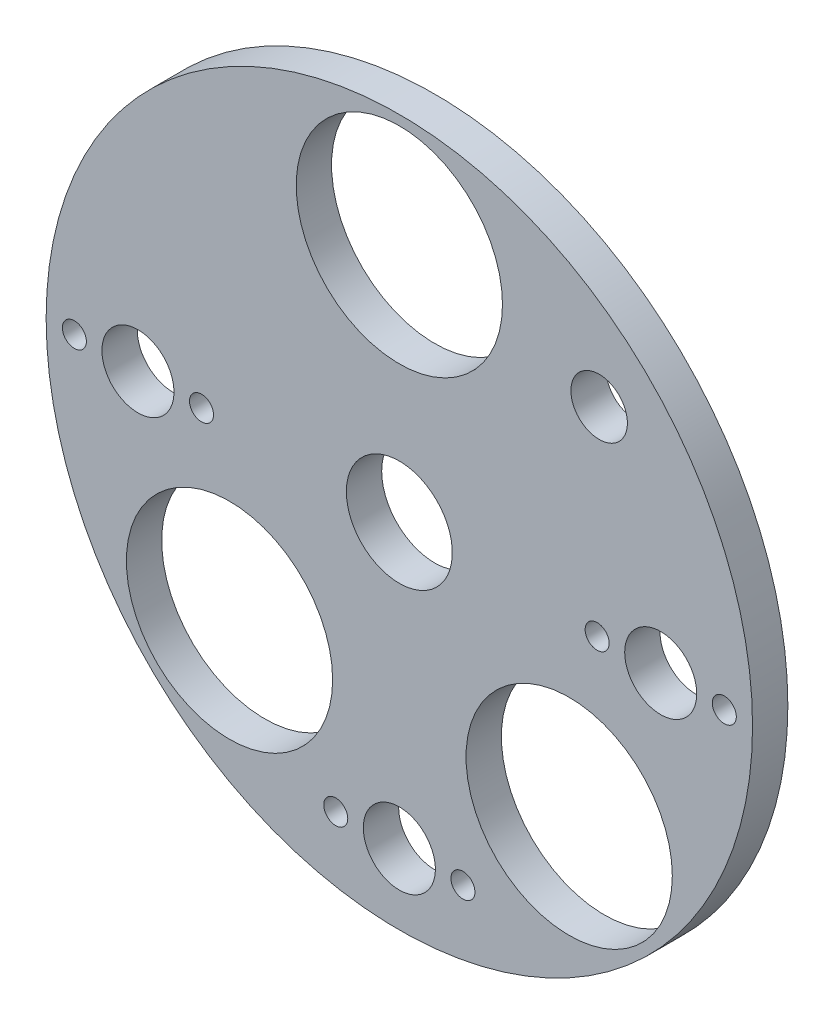
ISO-10303-21;
HEADER;
FILE_DESCRIPTION(('STEP AP214'),'2;1');
FILE_NAME('part.step','',(''),(''),'','','');
FILE_SCHEMA(('AUTOMOTIVE_DESIGN { 1 0 10303 214 1 1 1 1 }'));
ENDSEC;
DATA;
#1=APPLICATION_CONTEXT('core data for automotive mechanical design processes');
#2=APPLICATION_PROTOCOL_DEFINITION('international standard','automotive_design',2000,#1);
#3=PRODUCT_CONTEXT('',#1,'mechanical');
#4=PRODUCT('Part','Part','',(#3));
#5=PRODUCT_RELATED_PRODUCT_CATEGORY('part','',(#4));
#6=PRODUCT_DEFINITION_FORMATION('','',#4);
#7=PRODUCT_DEFINITION_CONTEXT('part definition',#1,'design');
#8=PRODUCT_DEFINITION('design','',#6,#7);
#9=PRODUCT_DEFINITION_SHAPE('','',#8);
#10=(LENGTH_UNIT() NAMED_UNIT(*) SI_UNIT(.MILLI.,.METRE.));
#11=(NAMED_UNIT(*) PLANE_ANGLE_UNIT() SI_UNIT($,.RADIAN.));
#12=(NAMED_UNIT(*) SI_UNIT($,.STERADIAN.) SOLID_ANGLE_UNIT());
#13=UNCERTAINTY_MEASURE_WITH_UNIT(LENGTH_MEASURE(1.E-05),#10,'distance_accuracy_value','');
#14=(GEOMETRIC_REPRESENTATION_CONTEXT(3) GLOBAL_UNCERTAINTY_ASSIGNED_CONTEXT((#13)) GLOBAL_UNIT_ASSIGNED_CONTEXT((#10,
#11,#12)) REPRESENTATION_CONTEXT('',''));
#15=CARTESIAN_POINT('',(0.,0.,0.));
#16=DIRECTION('',(0.,0.,1.));
#17=DIRECTION('',(1.,0.,0.));
#18=AXIS2_PLACEMENT_3D('',#15,#16,#17);
#19=CARTESIAN_POINT('',(0.,0.,5.));
#20=DIRECTION('',(0.,0.,-1.));
#21=DIRECTION('',(-1.,0.,0.));
#22=AXIS2_PLACEMENT_3D('',#19,#20,#21);
#23=CYLINDRICAL_SURFACE('',#22,50.);
#24=CARTESIAN_POINT('',(0.,0.,5.));
#25=DIRECTION('',(0.,0.,1.));
#26=DIRECTION('',(1.,0.,0.));
#27=AXIS2_PLACEMENT_3D('',#24,#25,#26);
#28=CIRCLE('',#27,50.);
#29=CARTESIAN_POINT('',(50.,0.,5.));
#30=VERTEX_POINT('',#29);
#31=EDGE_CURVE('E10',#30,#30,#28,.T.);
#32=ORIENTED_EDGE('',*,*,#31,.F.);
#33=EDGE_LOOP('',(#32));
#34=FACE_BOUND('',#33,.T.);
#35=CARTESIAN_POINT('',(0.,0.,0.));
#36=DIRECTION('',(0.,0.,1.));
#37=DIRECTION('',(1.,0.,0.));
#38=AXIS2_PLACEMENT_3D('',#35,#36,#37);
#39=CIRCLE('',#38,50.);
#40=CARTESIAN_POINT('',(50.,0.,0.));
#41=VERTEX_POINT('',#40);
#42=EDGE_CURVE('E39',#41,#41,#39,.T.);
#43=ORIENTED_EDGE('',*,*,#42,.T.);
#44=EDGE_LOOP('',(#43));
#45=FACE_BOUND('',#44,.T.);
#46=ADVANCED_FACE('F32',(#34,#45),#23,.T.);
#47=CARTESIAN_POINT('',(0.,0.,5.));
#48=DIRECTION('',(0.,0.,1.));
#49=DIRECTION('',(1.,0.,0.));
#50=AXIS2_PLACEMENT_3D('',#47,#48,#49);
#51=PLANE('',#50);
#52=CARTESIAN_POINT('',(28.284271247462,28.2842712474618,5.));
#53=DIRECTION('',(0.,0.,1.));
#54=DIRECTION('',(1.,0.,0.));
#55=AXIS2_PLACEMENT_3D('',#52,#53,#54);
#56=CIRCLE('',#55,4.);
#57=CARTESIAN_POINT('',(32.284271247462,28.2842712474618,5.));
#58=VERTEX_POINT('',#57);
#59=EDGE_CURVE('E154',#58,#58,#56,.T.);
#60=ORIENTED_EDGE('',*,*,#59,.F.);
#61=EDGE_LOOP('',(#60));
#62=FACE_BOUND('',#61,.T.);
#63=CARTESIAN_POINT('',(0.,34.,5.));
#64=DIRECTION('',(0.,0.,1.));
#65=DIRECTION('',(1.,0.,0.));
#66=AXIS2_PLACEMENT_3D('',#63,#64,#65);
#67=CIRCLE('',#66,14.6);
#68=CARTESIAN_POINT('',(14.6,34.,5.));
#69=VERTEX_POINT('',#68);
#70=EDGE_CURVE('E158',#69,#69,#67,.T.);
#71=ORIENTED_EDGE('',*,*,#70,.F.);
#72=EDGE_LOOP('',(#71));
#73=FACE_BOUND('',#72,.T.);
#74=CARTESIAN_POINT('',(-24.0416305603427,-24.0416305603425,5.));
#75=DIRECTION('',(0.,0.,1.));
#76=DIRECTION('',(1.,0.,0.));
#77=AXIS2_PLACEMENT_3D('',#74,#75,#76);
#78=CIRCLE('',#77,14.6);
#79=CARTESIAN_POINT('',(-9.44163056034274,-24.0416305603425,5.));
#80=VERTEX_POINT('',#79);
#81=EDGE_CURVE('E162',#80,#80,#78,.T.);
#82=ORIENTED_EDGE('',*,*,#81,.F.);
#83=EDGE_LOOP('',(#82));
#84=FACE_BOUND('',#83,.T.);
#85=CARTESIAN_POINT('',(24.0416305603426,-24.0416305603427,5.));
#86=DIRECTION('',(0.,0.,1.));
#87=DIRECTION('',(1.,0.,0.));
#88=AXIS2_PLACEMENT_3D('',#85,#86,#87);
#89=CIRCLE('',#88,14.6);
#90=CARTESIAN_POINT('',(38.6416305603426,-24.0416305603427,5.));
#91=VERTEX_POINT('',#90);
#92=EDGE_CURVE('E53',#91,#91,#89,.T.);
#93=ORIENTED_EDGE('',*,*,#92,.F.);
#94=EDGE_LOOP('',(#93));
#95=FACE_BOUND('',#94,.T.);
#96=CARTESIAN_POINT('',(46.,0.,5.));
#97=DIRECTION('',(0.,0.,1.));
#98=DIRECTION('',(1.,0.,0.));
#99=AXIS2_PLACEMENT_3D('',#96,#97,#98);
#100=CIRCLE('',#99,1.7);
#101=CARTESIAN_POINT('',(47.7,0.,5.));
#102=VERTEX_POINT('',#101);
#103=EDGE_CURVE('E57',#102,#102,#100,.T.);
#104=ORIENTED_EDGE('',*,*,#103,.F.);
#105=EDGE_LOOP('',(#104));
#106=FACE_BOUND('',#105,.T.);
#107=CARTESIAN_POINT('',(28.,0.,5.));
#108=DIRECTION('',(0.,0.,1.));
#109=DIRECTION('',(1.,0.,0.));
#110=AXIS2_PLACEMENT_3D('',#107,#108,#109);
#111=CIRCLE('',#110,1.7);
#112=CARTESIAN_POINT('',(29.7,0.,5.));
#113=VERTEX_POINT('',#112);
#114=EDGE_CURVE('E66',#113,#113,#111,.T.);
#115=ORIENTED_EDGE('',*,*,#114,.F.);
#116=EDGE_LOOP('',(#115));
#117=FACE_BOUND('',#116,.T.);
#118=CARTESIAN_POINT('',(9.,-40.,5.));
#119=DIRECTION('',(0.,0.,1.));
#120=DIRECTION('',(1.,0.,0.));
#121=AXIS2_PLACEMENT_3D('',#118,#119,#120);
#122=CIRCLE('',#121,1.7);
#123=CARTESIAN_POINT('',(10.7,-40.,5.));
#124=VERTEX_POINT('',#123);
#125=EDGE_CURVE('E76',#124,#124,#122,.T.);
#126=ORIENTED_EDGE('',*,*,#125,.F.);
#127=EDGE_LOOP('',(#126));
#128=FACE_BOUND('',#127,.T.);
#129=CARTESIAN_POINT('',(-9.,-40.,5.));
#130=DIRECTION('',(0.,0.,1.));
#131=DIRECTION('',(1.,0.,0.));
#132=AXIS2_PLACEMENT_3D('',#129,#130,#131);
#133=CIRCLE('',#132,1.7);
#134=CARTESIAN_POINT('',(-7.3,-40.,5.));
#135=VERTEX_POINT('',#134);
#136=EDGE_CURVE('E82',#135,#135,#133,.T.);
#137=ORIENTED_EDGE('',*,*,#136,.F.);
#138=EDGE_LOOP('',(#137));
#139=FACE_BOUND('',#138,.T.);
#140=CARTESIAN_POINT('',(-46.,2.97129651685814E-13,5.));
#141=DIRECTION('',(0.,0.,1.));
#142=DIRECTION('',(1.,0.,0.));
#143=AXIS2_PLACEMENT_3D('',#140,#141,#142);
#144=CIRCLE('',#143,1.7);
#145=CARTESIAN_POINT('',(-44.3,2.97129651685814E-13,5.));
#146=VERTEX_POINT('',#145);
#147=EDGE_CURVE('E88',#146,#146,#144,.T.);
#148=ORIENTED_EDGE('',*,*,#147,.F.);
#149=EDGE_LOOP('',(#148));
#150=FACE_BOUND('',#149,.T.);
#151=CARTESIAN_POINT('',(-28.,-1.71810817162361E-12,5.));
#152=DIRECTION('',(0.,0.,1.));
#153=DIRECTION('',(1.,0.,0.));
#154=AXIS2_PLACEMENT_3D('',#151,#152,#153);
#155=CIRCLE('',#154,1.7);
#156=CARTESIAN_POINT('',(-26.3,-1.71810817162361E-12,5.));
#157=VERTEX_POINT('',#156);
#158=EDGE_CURVE('E94',#157,#157,#155,.T.);
#159=ORIENTED_EDGE('',*,*,#158,.F.);
#160=EDGE_LOOP('',(#159));
#161=FACE_BOUND('',#160,.T.);
#162=CARTESIAN_POINT('',(-37.,0.,5.));
#163=DIRECTION('',(0.,0.,-1.));
#164=DIRECTION('',(-1.,0.,0.));
#165=AXIS2_PLACEMENT_3D('',#162,#163,#164);
#166=CIRCLE('',#165,5.1);
#167=CARTESIAN_POINT('',(-42.1,0.,5.));
#168=VERTEX_POINT('',#167);
#169=EDGE_CURVE('E103',#168,#168,#166,.T.);
#170=ORIENTED_EDGE('',*,*,#169,.T.);
#171=EDGE_LOOP('',(#170));
#172=FACE_BOUND('',#171,.T.);
#173=CARTESIAN_POINT('',(37.,2.68166793467571E-13,5.));
#174=DIRECTION('',(0.,0.,-1.));
#175=DIRECTION('',(-1.,0.,0.));
#176=AXIS2_PLACEMENT_3D('',#173,#174,#175);
#177=CIRCLE('',#176,5.1);
#178=CARTESIAN_POINT('',(31.9,2.68166793467571E-13,5.));
#179=VERTEX_POINT('',#178);
#180=EDGE_CURVE('E109',#179,#179,#177,.T.);
#181=ORIENTED_EDGE('',*,*,#180,.T.);
#182=EDGE_LOOP('',(#181));
#183=FACE_BOUND('',#182,.T.);
#184=CARTESIAN_POINT('',(0.,-40.,5.));
#185=DIRECTION('',(0.,0.,-1.));
#186=DIRECTION('',(-1.,0.,0.));
#187=AXIS2_PLACEMENT_3D('',#184,#185,#186);
#188=CIRCLE('',#187,5.1);
#189=CARTESIAN_POINT('',(-5.1,-40.,5.));
#190=VERTEX_POINT('',#189);
#191=EDGE_CURVE('E115',#190,#190,#188,.T.);
#192=ORIENTED_EDGE('',*,*,#191,.T.);
#193=EDGE_LOOP('',(#192));
#194=FACE_BOUND('',#193,.T.);
#195=CARTESIAN_POINT('',(0.,0.,5.));
#196=DIRECTION('',(0.,0.,-1.));
#197=DIRECTION('',(-1.,0.,0.));
#198=AXIS2_PLACEMENT_3D('',#195,#196,#197);
#199=CIRCLE('',#198,7.5);
#200=CARTESIAN_POINT('',(-7.5,0.,5.));
#201=VERTEX_POINT('',#200);
#202=EDGE_CURVE('E44',#201,#201,#199,.T.);
#203=ORIENTED_EDGE('',*,*,#202,.T.);
#204=EDGE_LOOP('',(#203));
#205=FACE_BOUND('',#204,.T.);
#206=ORIENTED_EDGE('',*,*,#31,.T.);
#207=EDGE_LOOP('',(#206));
#208=FACE_BOUND('',#207,.T.);
#209=ADVANCED_FACE('F124',(#62,#73,#84,#95,#106,#117,#128,#139,#150,#161,#172,#183,#194,#205,
#208),#51,.T.);
#210=CARTESIAN_POINT('',(0.,0.,0.));
#211=DIRECTION('',(0.,0.,1.));
#212=DIRECTION('',(1.,0.,0.));
#213=AXIS2_PLACEMENT_3D('',#210,#211,#212);
#214=PLANE('',#213);
#215=CARTESIAN_POINT('',(28.284271247462,28.2842712474618,0.));
#216=DIRECTION('',(0.,0.,1.));
#217=DIRECTION('',(1.,0.,0.));
#218=AXIS2_PLACEMENT_3D('',#215,#216,#217);
#219=CIRCLE('',#218,4.);
#220=CARTESIAN_POINT('',(32.284271247462,28.2842712474618,0.));
#221=VERTEX_POINT('',#220);
#222=EDGE_CURVE('E35',#221,#221,#219,.T.);
#223=ORIENTED_EDGE('',*,*,#222,.T.);
#224=EDGE_LOOP('',(#223));
#225=FACE_BOUND('',#224,.T.);
#226=CARTESIAN_POINT('',(0.,34.,0.));
#227=DIRECTION('',(0.,0.,1.));
#228=DIRECTION('',(1.,0.,0.));
#229=AXIS2_PLACEMENT_3D('',#226,#227,#228);
#230=CIRCLE('',#229,14.6);
#231=CARTESIAN_POINT('',(14.6,34.,0.));
#232=VERTEX_POINT('',#231);
#233=EDGE_CURVE('E55',#232,#232,#230,.T.);
#234=ORIENTED_EDGE('',*,*,#233,.T.);
#235=EDGE_LOOP('',(#234));
#236=FACE_BOUND('',#235,.T.);
#237=CARTESIAN_POINT('',(-24.0416305603427,-24.0416305603425,0.));
#238=DIRECTION('',(0.,0.,1.));
#239=DIRECTION('',(1.,0.,0.));
#240=AXIS2_PLACEMENT_3D('',#237,#238,#239);
#241=CIRCLE('',#240,14.6);
#242=CARTESIAN_POINT('',(-9.44163056034274,-24.0416305603425,0.));
#243=VERTEX_POINT('',#242);
#244=EDGE_CURVE('E52',#243,#243,#241,.T.);
#245=ORIENTED_EDGE('',*,*,#244,.T.);
#246=EDGE_LOOP('',(#245));
#247=FACE_BOUND('',#246,.T.);
#248=CARTESIAN_POINT('',(24.0416305603426,-24.0416305603427,0.));
#249=DIRECTION('',(0.,0.,1.));
#250=DIRECTION('',(1.,0.,0.));
#251=AXIS2_PLACEMENT_3D('',#248,#249,#250);
#252=CIRCLE('',#251,14.6);
#253=CARTESIAN_POINT('',(38.6416305603426,-24.0416305603427,0.));
#254=VERTEX_POINT('',#253);
#255=EDGE_CURVE('E49',#254,#254,#252,.T.);
#256=ORIENTED_EDGE('',*,*,#255,.T.);
#257=EDGE_LOOP('',(#256));
#258=FACE_BOUND('',#257,.T.);
#259=CARTESIAN_POINT('',(46.,0.,0.));
#260=DIRECTION('',(0.,0.,1.));
#261=DIRECTION('',(1.,0.,0.));
#262=AXIS2_PLACEMENT_3D('',#259,#260,#261);
#263=CIRCLE('',#262,1.7);
#264=CARTESIAN_POINT('',(47.7,0.,0.));
#265=VERTEX_POINT('',#264);
#266=EDGE_CURVE('E61',#265,#265,#263,.T.);
#267=ORIENTED_EDGE('',*,*,#266,.T.);
#268=EDGE_LOOP('',(#267));
#269=FACE_BOUND('',#268,.T.);
#270=CARTESIAN_POINT('',(28.,0.,0.));
#271=DIRECTION('',(0.,0.,1.));
#272=DIRECTION('',(1.,0.,0.));
#273=AXIS2_PLACEMENT_3D('',#270,#271,#272);
#274=CIRCLE('',#273,1.7);
#275=CARTESIAN_POINT('',(29.7,0.,0.));
#276=VERTEX_POINT('',#275);
#277=EDGE_CURVE('E73',#276,#276,#274,.T.);
#278=ORIENTED_EDGE('',*,*,#277,.T.);
#279=EDGE_LOOP('',(#278));
#280=FACE_BOUND('',#279,.T.);
#281=CARTESIAN_POINT('',(9.,-40.,0.));
#282=DIRECTION('',(0.,0.,1.));
#283=DIRECTION('',(1.,0.,0.));
#284=AXIS2_PLACEMENT_3D('',#281,#282,#283);
#285=CIRCLE('',#284,1.7);
#286=CARTESIAN_POINT('',(10.7,-40.,0.));
#287=VERTEX_POINT('',#286);
#288=EDGE_CURVE('E79',#287,#287,#285,.T.);
#289=ORIENTED_EDGE('',*,*,#288,.T.);
#290=EDGE_LOOP('',(#289));
#291=FACE_BOUND('',#290,.T.);
#292=CARTESIAN_POINT('',(-9.,-40.,0.));
#293=DIRECTION('',(0.,0.,1.));
#294=DIRECTION('',(1.,0.,0.));
#295=AXIS2_PLACEMENT_3D('',#292,#293,#294);
#296=CIRCLE('',#295,1.7);
#297=CARTESIAN_POINT('',(-7.3,-40.,0.));
#298=VERTEX_POINT('',#297);
#299=EDGE_CURVE('E85',#298,#298,#296,.T.);
#300=ORIENTED_EDGE('',*,*,#299,.T.);
#301=EDGE_LOOP('',(#300));
#302=FACE_BOUND('',#301,.T.);
#303=CARTESIAN_POINT('',(-46.,2.97129651685814E-13,0.));
#304=DIRECTION('',(0.,0.,1.));
#305=DIRECTION('',(1.,0.,0.));
#306=AXIS2_PLACEMENT_3D('',#303,#304,#305);
#307=CIRCLE('',#306,1.7);
#308=CARTESIAN_POINT('',(-44.3,2.97129651685814E-13,0.));
#309=VERTEX_POINT('',#308);
#310=EDGE_CURVE('E91',#309,#309,#307,.T.);
#311=ORIENTED_EDGE('',*,*,#310,.T.);
#312=EDGE_LOOP('',(#311));
#313=FACE_BOUND('',#312,.T.);
#314=CARTESIAN_POINT('',(-28.,-1.71810817162361E-12,0.));
#315=DIRECTION('',(0.,0.,1.));
#316=DIRECTION('',(1.,0.,0.));
#317=AXIS2_PLACEMENT_3D('',#314,#315,#316);
#318=CIRCLE('',#317,1.7);
#319=CARTESIAN_POINT('',(-26.3,-1.71810817162361E-12,0.));
#320=VERTEX_POINT('',#319);
#321=EDGE_CURVE('E97',#320,#320,#318,.T.);
#322=ORIENTED_EDGE('',*,*,#321,.T.);
#323=EDGE_LOOP('',(#322));
#324=FACE_BOUND('',#323,.T.);
#325=CARTESIAN_POINT('',(-37.,0.,0.));
#326=DIRECTION('',(0.,0.,-1.));
#327=DIRECTION('',(-1.,0.,0.));
#328=AXIS2_PLACEMENT_3D('',#325,#326,#327);
#329=CIRCLE('',#328,5.1);
#330=CARTESIAN_POINT('',(-42.1,0.,0.));
#331=VERTEX_POINT('',#330);
#332=EDGE_CURVE('E100',#331,#331,#329,.T.);
#333=ORIENTED_EDGE('',*,*,#332,.F.);
#334=EDGE_LOOP('',(#333));
#335=FACE_BOUND('',#334,.T.);
#336=CARTESIAN_POINT('',(37.,2.68166793467571E-13,0.));
#337=DIRECTION('',(0.,0.,-1.));
#338=DIRECTION('',(-1.,0.,0.));
#339=AXIS2_PLACEMENT_3D('',#336,#337,#338);
#340=CIRCLE('',#339,5.1);
#341=CARTESIAN_POINT('',(31.9,2.68166793467571E-13,0.));
#342=VERTEX_POINT('',#341);
#343=EDGE_CURVE('E106',#342,#342,#340,.T.);
#344=ORIENTED_EDGE('',*,*,#343,.F.);
#345=EDGE_LOOP('',(#344));
#346=FACE_BOUND('',#345,.T.);
#347=CARTESIAN_POINT('',(0.,-40.,0.));
#348=DIRECTION('',(0.,0.,-1.));
#349=DIRECTION('',(-1.,0.,0.));
#350=AXIS2_PLACEMENT_3D('',#347,#348,#349);
#351=CIRCLE('',#350,5.1);
#352=CARTESIAN_POINT('',(-5.1,-40.,0.));
#353=VERTEX_POINT('',#352);
#354=EDGE_CURVE('E112',#353,#353,#351,.T.);
#355=ORIENTED_EDGE('',*,*,#354,.F.);
#356=EDGE_LOOP('',(#355));
#357=FACE_BOUND('',#356,.T.);
#358=CARTESIAN_POINT('',(0.,0.,0.));
#359=DIRECTION('',(0.,0.,-1.));
#360=DIRECTION('',(-1.,0.,0.));
#361=AXIS2_PLACEMENT_3D('',#358,#359,#360);
#362=CIRCLE('',#361,7.5);
#363=CARTESIAN_POINT('',(-7.5,0.,0.));
#364=VERTEX_POINT('',#363);
#365=EDGE_CURVE('E117',#364,#364,#362,.T.);
#366=ORIENTED_EDGE('',*,*,#365,.F.);
#367=EDGE_LOOP('',(#366));
#368=FACE_BOUND('',#367,.T.);
#369=ORIENTED_EDGE('',*,*,#42,.F.);
#370=EDGE_LOOP('',(#369));
#371=FACE_BOUND('',#370,.T.);
#372=ADVANCED_FACE('F129',(#225,#236,#247,#258,#269,#280,#291,#302,#313,#324,#335,#346,#357,
#368,#371),#214,.F.);
#373=CARTESIAN_POINT('',(0.,0.,0.));
#374=DIRECTION('',(0.,0.,-1.));
#375=DIRECTION('',(-1.,0.,0.));
#376=AXIS2_PLACEMENT_3D('',#373,#374,#375);
#377=CYLINDRICAL_SURFACE('',#376,7.5);
#378=ORIENTED_EDGE('',*,*,#202,.F.);
#379=EDGE_LOOP('',(#378));
#380=FACE_BOUND('',#379,.T.);
#381=ORIENTED_EDGE('',*,*,#365,.T.);
#382=EDGE_LOOP('',(#381));
#383=FACE_BOUND('',#382,.T.);
#384=ADVANCED_FACE('F126',(#380,#383),#377,.F.);
#385=CARTESIAN_POINT('',(0.,-40.,0.));
#386=DIRECTION('',(0.,0.,-1.));
#387=DIRECTION('',(-1.,0.,0.));
#388=AXIS2_PLACEMENT_3D('',#385,#386,#387);
#389=CYLINDRICAL_SURFACE('',#388,5.1);
#390=ORIENTED_EDGE('',*,*,#191,.F.);
#391=EDGE_LOOP('',(#390));
#392=FACE_BOUND('',#391,.T.);
#393=ORIENTED_EDGE('',*,*,#354,.T.);
#394=EDGE_LOOP('',(#393));
#395=FACE_BOUND('',#394,.T.);
#396=ADVANCED_FACE('F128',(#392,#395),#389,.F.);
#397=CARTESIAN_POINT('',(37.,2.68166793467571E-13,0.));
#398=DIRECTION('',(0.,0.,-1.));
#399=DIRECTION('',(-1.,0.,0.));
#400=AXIS2_PLACEMENT_3D('',#397,#398,#399);
#401=CYLINDRICAL_SURFACE('',#400,5.1);
#402=ORIENTED_EDGE('',*,*,#180,.F.);
#403=EDGE_LOOP('',(#402));
#404=FACE_BOUND('',#403,.T.);
#405=ORIENTED_EDGE('',*,*,#343,.T.);
#406=EDGE_LOOP('',(#405));
#407=FACE_BOUND('',#406,.T.);
#408=ADVANCED_FACE('F135',(#404,#407),#401,.F.);
#409=CARTESIAN_POINT('',(-37.,0.,0.));
#410=DIRECTION('',(0.,0.,-1.));
#411=DIRECTION('',(-1.,0.,0.));
#412=AXIS2_PLACEMENT_3D('',#409,#410,#411);
#413=CYLINDRICAL_SURFACE('',#412,5.1);
#414=ORIENTED_EDGE('',*,*,#169,.F.);
#415=EDGE_LOOP('',(#414));
#416=FACE_BOUND('',#415,.T.);
#417=ORIENTED_EDGE('',*,*,#332,.T.);
#418=EDGE_LOOP('',(#417));
#419=FACE_BOUND('',#418,.T.);
#420=ADVANCED_FACE('F189',(#416,#419),#413,.F.);
#421=CARTESIAN_POINT('',(-28.,-1.71810817162361E-12,5.));
#422=DIRECTION('',(0.,0.,1.));
#423=DIRECTION('',(1.,0.,0.));
#424=AXIS2_PLACEMENT_3D('',#421,#422,#423);
#425=CYLINDRICAL_SURFACE('',#424,1.7);
#426=ORIENTED_EDGE('',*,*,#321,.F.);
#427=EDGE_LOOP('',(#426));
#428=FACE_BOUND('',#427,.T.);
#429=ORIENTED_EDGE('',*,*,#158,.T.);
#430=EDGE_LOOP('',(#429));
#431=FACE_BOUND('',#430,.T.);
#432=ADVANCED_FACE('F196',(#428,#431),#425,.F.);
#433=CARTESIAN_POINT('',(-46.,2.97129651685814E-13,5.));
#434=DIRECTION('',(0.,0.,1.));
#435=DIRECTION('',(1.,0.,0.));
#436=AXIS2_PLACEMENT_3D('',#433,#434,#435);
#437=CYLINDRICAL_SURFACE('',#436,1.7);
#438=ORIENTED_EDGE('',*,*,#310,.F.);
#439=EDGE_LOOP('',(#438));
#440=FACE_BOUND('',#439,.T.);
#441=ORIENTED_EDGE('',*,*,#147,.T.);
#442=EDGE_LOOP('',(#441));
#443=FACE_BOUND('',#442,.T.);
#444=ADVANCED_FACE('F202',(#440,#443),#437,.F.);
#445=CARTESIAN_POINT('',(-9.,-40.,5.));
#446=DIRECTION('',(0.,0.,1.));
#447=DIRECTION('',(1.,0.,0.));
#448=AXIS2_PLACEMENT_3D('',#445,#446,#447);
#449=CYLINDRICAL_SURFACE('',#448,1.7);
#450=ORIENTED_EDGE('',*,*,#299,.F.);
#451=EDGE_LOOP('',(#450));
#452=FACE_BOUND('',#451,.T.);
#453=ORIENTED_EDGE('',*,*,#136,.T.);
#454=EDGE_LOOP('',(#453));
#455=FACE_BOUND('',#454,.T.);
#456=ADVANCED_FACE('F206',(#452,#455),#449,.F.);
#457=CARTESIAN_POINT('',(9.,-40.,5.));
#458=DIRECTION('',(0.,0.,1.));
#459=DIRECTION('',(1.,0.,0.));
#460=AXIS2_PLACEMENT_3D('',#457,#458,#459);
#461=CYLINDRICAL_SURFACE('',#460,1.7);
#462=ORIENTED_EDGE('',*,*,#288,.F.);
#463=EDGE_LOOP('',(#462));
#464=FACE_BOUND('',#463,.T.);
#465=ORIENTED_EDGE('',*,*,#125,.T.);
#466=EDGE_LOOP('',(#465));
#467=FACE_BOUND('',#466,.T.);
#468=ADVANCED_FACE('F210',(#464,#467),#461,.F.);
#469=CARTESIAN_POINT('',(28.,0.,5.));
#470=DIRECTION('',(0.,0.,1.));
#471=DIRECTION('',(1.,0.,0.));
#472=AXIS2_PLACEMENT_3D('',#469,#470,#471);
#473=CYLINDRICAL_SURFACE('',#472,1.7);
#474=ORIENTED_EDGE('',*,*,#277,.F.);
#475=EDGE_LOOP('',(#474));
#476=FACE_BOUND('',#475,.T.);
#477=ORIENTED_EDGE('',*,*,#114,.T.);
#478=EDGE_LOOP('',(#477));
#479=FACE_BOUND('',#478,.T.);
#480=ADVANCED_FACE('F214',(#476,#479),#473,.F.);
#481=CARTESIAN_POINT('',(46.,0.,5.));
#482=DIRECTION('',(0.,0.,1.));
#483=DIRECTION('',(1.,0.,0.));
#484=AXIS2_PLACEMENT_3D('',#481,#482,#483);
#485=CYLINDRICAL_SURFACE('',#484,1.7);
#486=ORIENTED_EDGE('',*,*,#266,.F.);
#487=EDGE_LOOP('',(#486));
#488=FACE_BOUND('',#487,.T.);
#489=ORIENTED_EDGE('',*,*,#103,.T.);
#490=EDGE_LOOP('',(#489));
#491=FACE_BOUND('',#490,.T.);
#492=ADVANCED_FACE('F218',(#488,#491),#485,.F.);
#493=CARTESIAN_POINT('',(24.0416305603426,-24.0416305603427,-5.));
#494=DIRECTION('',(0.,0.,1.));
#495=DIRECTION('',(1.,0.,0.));
#496=AXIS2_PLACEMENT_3D('',#493,#494,#495);
#497=CYLINDRICAL_SURFACE('',#496,14.6);
#498=ORIENTED_EDGE('',*,*,#92,.T.);
#499=EDGE_LOOP('',(#498));
#500=FACE_BOUND('',#499,.T.);
#501=ORIENTED_EDGE('',*,*,#255,.F.);
#502=EDGE_LOOP('',(#501));
#503=FACE_BOUND('',#502,.T.);
#504=ADVANCED_FACE('F222',(#500,#503),#497,.F.);
#505=CARTESIAN_POINT('',(-24.0416305603427,-24.0416305603425,-5.));
#506=DIRECTION('',(0.,0.,1.));
#507=DIRECTION('',(1.,0.,0.));
#508=AXIS2_PLACEMENT_3D('',#505,#506,#507);
#509=CYLINDRICAL_SURFACE('',#508,14.6);
#510=ORIENTED_EDGE('',*,*,#81,.T.);
#511=EDGE_LOOP('',(#510));
#512=FACE_BOUND('',#511,.T.);
#513=ORIENTED_EDGE('',*,*,#244,.F.);
#514=EDGE_LOOP('',(#513));
#515=FACE_BOUND('',#514,.T.);
#516=ADVANCED_FACE('F226',(#512,#515),#509,.F.);
#517=CARTESIAN_POINT('',(0.,34.,-5.));
#518=DIRECTION('',(0.,0.,1.));
#519=DIRECTION('',(1.,0.,0.));
#520=AXIS2_PLACEMENT_3D('',#517,#518,#519);
#521=CYLINDRICAL_SURFACE('',#520,14.6);
#522=ORIENTED_EDGE('',*,*,#70,.T.);
#523=EDGE_LOOP('',(#522));
#524=FACE_BOUND('',#523,.T.);
#525=ORIENTED_EDGE('',*,*,#233,.F.);
#526=EDGE_LOOP('',(#525));
#527=FACE_BOUND('',#526,.T.);
#528=ADVANCED_FACE('F228',(#524,#527),#521,.F.);
#529=CARTESIAN_POINT('',(28.284271247462,28.2842712474618,-5.));
#530=DIRECTION('',(0.,0.,1.));
#531=DIRECTION('',(1.,0.,0.));
#532=AXIS2_PLACEMENT_3D('',#529,#530,#531);
#533=CYLINDRICAL_SURFACE('',#532,4.);
#534=ORIENTED_EDGE('',*,*,#59,.T.);
#535=EDGE_LOOP('',(#534));
#536=FACE_BOUND('',#535,.T.);
#537=ORIENTED_EDGE('',*,*,#222,.F.);
#538=EDGE_LOOP('',(#537));
#539=FACE_BOUND('',#538,.T.);
#540=ADVANCED_FACE('F231',(#536,#539),#533,.F.);
#541=CLOSED_SHELL('',(#46,#209,#372,#384,#396,#408,#420,#432,#444,#456,#468,#480,#492,#504,#516,
#528,#540));
#542=MANIFOLD_SOLID_BREP('B2',#541);
#543=ADVANCED_BREP_SHAPE_REPRESENTATION('',(#18,#542),#14);
#544=SHAPE_DEFINITION_REPRESENTATION(#9,#543);
ENDSEC;
END-ISO-10303-21;
